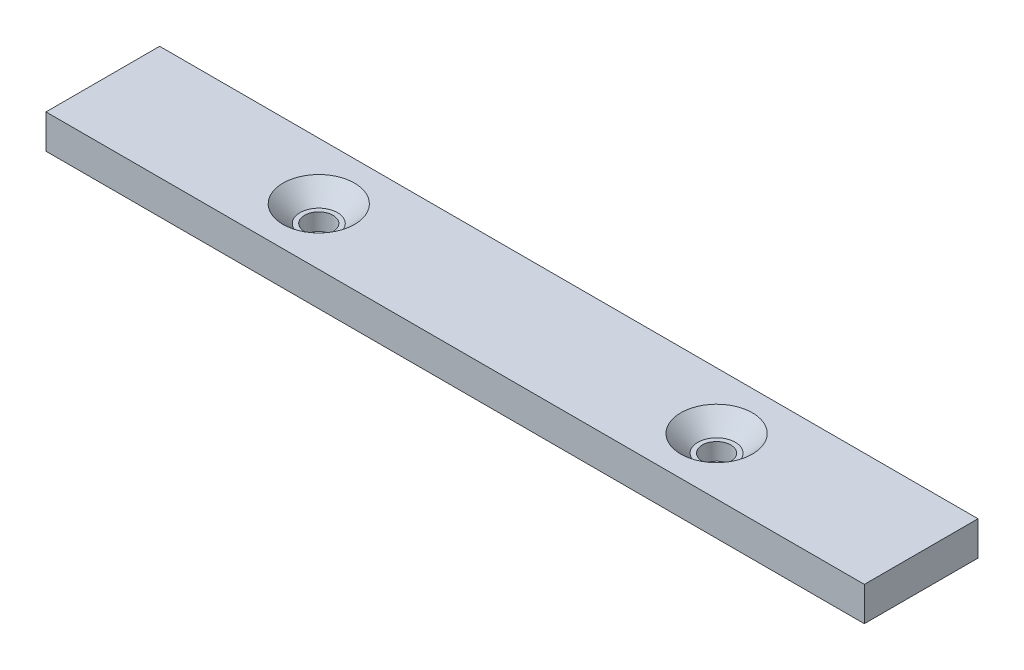
ISO-10303-21;
HEADER;
FILE_DESCRIPTION(('STEP AP214'),'2;1');
FILE_NAME('part.step','',(''),(''),'','','');
FILE_SCHEMA(('AUTOMOTIVE_DESIGN { 1 0 10303 214 1 1 1 1 }'));
ENDSEC;
DATA;
#1=APPLICATION_CONTEXT('core data for automotive mechanical design processes');
#2=APPLICATION_PROTOCOL_DEFINITION('international standard','automotive_design',2000,#1);
#3=PRODUCT_CONTEXT('',#1,'mechanical');
#4=PRODUCT('Part','Part','',(#3));
#5=PRODUCT_RELATED_PRODUCT_CATEGORY('part','',(#4));
#6=PRODUCT_DEFINITION_FORMATION('','',#4);
#7=PRODUCT_DEFINITION_CONTEXT('part definition',#1,'design');
#8=PRODUCT_DEFINITION('design','',#6,#7);
#9=PRODUCT_DEFINITION_SHAPE('','',#8);
#10=(LENGTH_UNIT() NAMED_UNIT(*) SI_UNIT(.MILLI.,.METRE.));
#11=(NAMED_UNIT(*) PLANE_ANGLE_UNIT() SI_UNIT($,.RADIAN.));
#12=(NAMED_UNIT(*) SI_UNIT($,.STERADIAN.) SOLID_ANGLE_UNIT());
#13=UNCERTAINTY_MEASURE_WITH_UNIT(LENGTH_MEASURE(1.E-05),#10,'distance_accuracy_value','');
#14=(GEOMETRIC_REPRESENTATION_CONTEXT(3) GLOBAL_UNCERTAINTY_ASSIGNED_CONTEXT((#13)) GLOBAL_UNIT_ASSIGNED_CONTEXT((#10,
#11,#12)) REPRESENTATION_CONTEXT('',''));
#15=CARTESIAN_POINT('',(0.,0.,0.));
#16=DIRECTION('',(0.,0.,1.));
#17=DIRECTION('',(1.,0.,0.));
#18=AXIS2_PLACEMENT_3D('',#15,#16,#17);
#19=CARTESIAN_POINT('',(-72.,6.,10.));
#20=DIRECTION('',(1.,0.,0.));
#21=DIRECTION('',(0.,0.,-1.));
#22=AXIS2_PLACEMENT_3D('',#19,#20,#21);
#23=PLANE('',#22);
#24=DIRECTION('',(0.,0.,1.));
#25=VECTOR('',#24,1.);
#26=CARTESIAN_POINT('',(-72.,0.,10.));
#27=LINE('',#26,#25);
#28=CARTESIAN_POINT('',(-72.,0.,-9.99999999999999));
#29=VERTEX_POINT('',#28);
#30=CARTESIAN_POINT('',(-72.,0.,10.));
#31=VERTEX_POINT('',#30);
#32=EDGE_CURVE('E110',#29,#31,#27,.T.);
#33=ORIENTED_EDGE('',*,*,#32,.T.);
#34=DIRECTION('',(0.,-1.,0.));
#35=VECTOR('',#34,1.);
#36=CARTESIAN_POINT('',(-72.,6.,10.));
#37=LINE('',#36,#35);
#38=CARTESIAN_POINT('',(-72.,6.,10.));
#39=VERTEX_POINT('',#38);
#40=EDGE_CURVE('E11',#39,#31,#37,.T.);
#41=ORIENTED_EDGE('',*,*,#40,.F.);
#42=DIRECTION('',(0.,0.,1.));
#43=VECTOR('',#42,1.);
#44=CARTESIAN_POINT('',(-72.,6.,10.));
#45=LINE('',#44,#43);
#46=CARTESIAN_POINT('',(-72.,6.,-9.99999999999999));
#47=VERTEX_POINT('',#46);
#48=EDGE_CURVE('E93',#47,#39,#45,.T.);
#49=ORIENTED_EDGE('',*,*,#48,.F.);
#50=DIRECTION('',(0.,-1.,0.));
#51=VECTOR('',#50,1.);
#52=CARTESIAN_POINT('',(-72.,6.,-9.99999999999999));
#53=LINE('',#52,#51);
#54=EDGE_CURVE('E106',#47,#29,#53,.T.);
#55=ORIENTED_EDGE('',*,*,#54,.T.);
#56=EDGE_LOOP('',(#33,#41,#49,#55));
#57=FACE_BOUND('',#56,.T.);
#58=ADVANCED_FACE('F39',(#57),#23,.F.);
#59=CARTESIAN_POINT('',(72.,6.,9.99999999999998));
#60=DIRECTION('',(0.,0.,-1.));
#61=DIRECTION('',(-1.,0.,0.));
#62=AXIS2_PLACEMENT_3D('',#59,#60,#61);
#63=PLANE('',#62);
#64=DIRECTION('',(1.,0.,0.));
#65=VECTOR('',#64,1.);
#66=CARTESIAN_POINT('',(72.,0.,9.99999999999998));
#67=LINE('',#66,#65);
#68=CARTESIAN_POINT('',(72.,0.,9.99999999999998));
#69=VERTEX_POINT('',#68);
#70=EDGE_CURVE('E98',#31,#69,#67,.T.);
#71=ORIENTED_EDGE('',*,*,#70,.T.);
#72=DIRECTION('',(0.,-1.,0.));
#73=VECTOR('',#72,1.);
#74=CARTESIAN_POINT('',(72.,6.,9.99999999999998));
#75=LINE('',#74,#73);
#76=CARTESIAN_POINT('',(72.,6.,9.99999999999998));
#77=VERTEX_POINT('',#76);
#78=EDGE_CURVE('E49',#77,#69,#75,.T.);
#79=ORIENTED_EDGE('',*,*,#78,.F.);
#80=DIRECTION('',(1.,0.,0.));
#81=VECTOR('',#80,1.);
#82=CARTESIAN_POINT('',(72.,6.,9.99999999999998));
#83=LINE('',#82,#81);
#84=EDGE_CURVE('E88',#39,#77,#83,.T.);
#85=ORIENTED_EDGE('',*,*,#84,.F.);
#86=ORIENTED_EDGE('',*,*,#40,.T.);
#87=EDGE_LOOP('',(#71,#79,#85,#86));
#88=FACE_BOUND('',#87,.T.);
#89=ADVANCED_FACE('F97',(#88),#63,.F.);
#90=CARTESIAN_POINT('',(72.,6.,9.99999999999998));
#91=DIRECTION('',(-1.,0.,0.));
#92=DIRECTION('',(0.,0.,1.));
#93=AXIS2_PLACEMENT_3D('',#90,#91,#92);
#94=PLANE('',#93);
#95=DIRECTION('',(0.,0.,-1.));
#96=VECTOR('',#95,1.);
#97=CARTESIAN_POINT('',(72.,0.,9.99999999999998));
#98=LINE('',#97,#96);
#99=CARTESIAN_POINT('',(72.,0.,-10.));
#100=VERTEX_POINT('',#99);
#101=EDGE_CURVE('E75',#69,#100,#98,.T.);
#102=ORIENTED_EDGE('',*,*,#101,.T.);
#103=DIRECTION('',(0.,-1.,0.));
#104=VECTOR('',#103,1.);
#105=CARTESIAN_POINT('',(72.,6.,-10.));
#106=LINE('',#105,#104);
#107=CARTESIAN_POINT('',(72.,6.,-10.));
#108=VERTEX_POINT('',#107);
#109=EDGE_CURVE('E100',#108,#100,#106,.T.);
#110=ORIENTED_EDGE('',*,*,#109,.F.);
#111=DIRECTION('',(0.,0.,-1.));
#112=VECTOR('',#111,1.);
#113=CARTESIAN_POINT('',(72.,6.,9.99999999999998));
#114=LINE('',#113,#112);
#115=EDGE_CURVE('E91',#77,#108,#114,.T.);
#116=ORIENTED_EDGE('',*,*,#115,.F.);
#117=ORIENTED_EDGE('',*,*,#78,.T.);
#118=EDGE_LOOP('',(#102,#110,#116,#117));
#119=FACE_BOUND('',#118,.T.);
#120=ADVANCED_FACE('F102',(#119),#94,.F.);
#121=CARTESIAN_POINT('',(72.,6.,-10.));
#122=DIRECTION('',(0.,0.,1.));
#123=DIRECTION('',(1.,0.,0.));
#124=AXIS2_PLACEMENT_3D('',#121,#122,#123);
#125=PLANE('',#124);
#126=DIRECTION('',(-1.,0.,0.));
#127=VECTOR('',#126,1.);
#128=CARTESIAN_POINT('',(72.,0.,-10.));
#129=LINE('',#128,#127);
#130=EDGE_CURVE('E81',#100,#29,#129,.T.);
#131=ORIENTED_EDGE('',*,*,#130,.T.);
#132=ORIENTED_EDGE('',*,*,#54,.F.);
#133=DIRECTION('',(-1.,0.,0.));
#134=VECTOR('',#133,1.);
#135=CARTESIAN_POINT('',(72.,6.,-10.));
#136=LINE('',#135,#134);
#137=EDGE_CURVE('E58',#108,#47,#136,.T.);
#138=ORIENTED_EDGE('',*,*,#137,.F.);
#139=ORIENTED_EDGE('',*,*,#109,.T.);
#140=EDGE_LOOP('',(#131,#132,#138,#139));
#141=FACE_BOUND('',#140,.T.);
#142=ADVANCED_FACE('F175',(#141),#125,.F.);
#143=CARTESIAN_POINT('',(0.,6.,0.));
#144=DIRECTION('',(0.,1.,0.));
#145=DIRECTION('',(0.,0.,1.));
#146=AXIS2_PLACEMENT_3D('',#143,#144,#145);
#147=PLANE('',#146);
#148=CARTESIAN_POINT('',(-34.,6.,0.));
#149=DIRECTION('',(0.,1.,0.));
#150=DIRECTION('',(0.,0.,1.));
#151=AXIS2_PLACEMENT_3D('',#148,#149,#150);
#152=CIRCLE('',#151,6.3);
#153=CARTESIAN_POINT('',(-34.,6.,6.3));
#154=VERTEX_POINT('',#153);
#155=EDGE_CURVE('E144',#154,#154,#152,.T.);
#156=ORIENTED_EDGE('',*,*,#155,.F.);
#157=EDGE_LOOP('',(#156));
#158=FACE_BOUND('',#157,.T.);
#159=CARTESIAN_POINT('',(36.,6.,0.));
#160=DIRECTION('',(0.,1.,0.));
#161=DIRECTION('',(0.,0.,1.));
#162=AXIS2_PLACEMENT_3D('',#159,#160,#161);
#163=CIRCLE('',#162,6.3);
#164=CARTESIAN_POINT('',(36.,6.,6.30000000000001));
#165=VERTEX_POINT('',#164);
#166=EDGE_CURVE('E126',#165,#165,#163,.T.);
#167=ORIENTED_EDGE('',*,*,#166,.F.);
#168=EDGE_LOOP('',(#167));
#169=FACE_BOUND('',#168,.T.);
#170=ORIENTED_EDGE('',*,*,#48,.T.);
#171=ORIENTED_EDGE('',*,*,#84,.T.);
#172=ORIENTED_EDGE('',*,*,#115,.T.);
#173=ORIENTED_EDGE('',*,*,#137,.T.);
#174=EDGE_LOOP('',(#170,#171,#172,#173));
#175=FACE_BOUND('',#174,.T.);
#176=ADVANCED_FACE('F89',(#158,#169,#175),#147,.T.);
#177=CARTESIAN_POINT('',(0.,0.,0.));
#178=DIRECTION('',(0.,1.,0.));
#179=DIRECTION('',(0.,0.,1.));
#180=AXIS2_PLACEMENT_3D('',#177,#178,#179);
#181=PLANE('',#180);
#182=CARTESIAN_POINT('',(-34.,0.,0.));
#183=DIRECTION('',(0.,1.,0.));
#184=DIRECTION('',(0.,0.,1.));
#185=AXIS2_PLACEMENT_3D('',#182,#183,#184);
#186=CIRCLE('',#185,2.5);
#187=CARTESIAN_POINT('',(-34.,0.,2.5));
#188=VERTEX_POINT('',#187);
#189=EDGE_CURVE('E42',#188,#188,#186,.T.);
#190=ORIENTED_EDGE('',*,*,#189,.T.);
#191=EDGE_LOOP('',(#190));
#192=FACE_BOUND('',#191,.T.);
#193=CARTESIAN_POINT('',(36.,0.,0.));
#194=DIRECTION('',(0.,1.,0.));
#195=DIRECTION('',(0.,0.,1.));
#196=AXIS2_PLACEMENT_3D('',#193,#194,#195);
#197=CIRCLE('',#196,2.5);
#198=CARTESIAN_POINT('',(36.,0.,2.50000000000001));
#199=VERTEX_POINT('',#198);
#200=EDGE_CURVE('E114',#199,#199,#197,.T.);
#201=ORIENTED_EDGE('',*,*,#200,.T.);
#202=EDGE_LOOP('',(#201));
#203=FACE_BOUND('',#202,.T.);
#204=ORIENTED_EDGE('',*,*,#32,.F.);
#205=ORIENTED_EDGE('',*,*,#130,.F.);
#206=ORIENTED_EDGE('',*,*,#101,.F.);
#207=ORIENTED_EDGE('',*,*,#70,.F.);
#208=EDGE_LOOP('',(#204,#205,#206,#207));
#209=FACE_BOUND('',#208,.T.);
#210=ADVANCED_FACE('F174',(#192,#203,#209),#181,.F.);
#211=CARTESIAN_POINT('',(36.,6.,0.));
#212=DIRECTION('',(0.,1.,0.));
#213=DIRECTION('',(0.,0.,1.));
#214=AXIS2_PLACEMENT_3D('',#211,#212,#213);
#215=CYLINDRICAL_SURFACE('',#214,2.5);
#216=CARTESIAN_POINT('',(36.,3.,0.));
#217=DIRECTION('',(0.,1.,0.));
#218=DIRECTION('',(0.,0.,1.));
#219=AXIS2_PLACEMENT_3D('',#216,#217,#218);
#220=CIRCLE('',#219,2.5);
#221=CARTESIAN_POINT('',(36.,3.,2.50000000000001));
#222=VERTEX_POINT('',#221);
#223=EDGE_CURVE('E137',#222,#222,#220,.T.);
#224=ORIENTED_EDGE('',*,*,#223,.T.);
#225=EDGE_LOOP('',(#224));
#226=FACE_BOUND('',#225,.T.);
#227=ORIENTED_EDGE('',*,*,#200,.F.);
#228=EDGE_LOOP('',(#227));
#229=FACE_BOUND('',#228,.T.);
#230=ADVANCED_FACE('F181',(#226,#229),#215,.F.);
#231=CARTESIAN_POINT('',(36.,6.,0.));
#232=DIRECTION('',(0.,1.,0.));
#233=DIRECTION('',(0.,0.,1.));
#234=AXIS2_PLACEMENT_3D('',#231,#232,#233);
#235=CONICAL_SURFACE('',#234,6.3,0.785398163397449);
#236=CARTESIAN_POINT('',(36.,3.,0.));
#237=DIRECTION('',(0.,1.,0.));
#238=DIRECTION('',(0.,0.,1.));
#239=AXIS2_PLACEMENT_3D('',#236,#237,#238);
#240=CIRCLE('',#239,3.3);
#241=CARTESIAN_POINT('',(36.,3.,3.3));
#242=VERTEX_POINT('',#241);
#243=EDGE_CURVE('E131',#242,#242,#240,.T.);
#244=ORIENTED_EDGE('',*,*,#243,.F.);
#245=EDGE_LOOP('',(#244));
#246=FACE_BOUND('',#245,.T.);
#247=ORIENTED_EDGE('',*,*,#166,.T.);
#248=EDGE_LOOP('',(#247));
#249=FACE_BOUND('',#248,.T.);
#250=ADVANCED_FACE('F222',(#246,#249),#235,.F.);
#251=CARTESIAN_POINT('',(39.3,3.,0.));
#252=DIRECTION('',(0.,-1.,0.));
#253=DIRECTION('',(0.,0.,-1.));
#254=AXIS2_PLACEMENT_3D('',#251,#252,#253);
#255=PLANE('',#254);
#256=ORIENTED_EDGE('',*,*,#223,.F.);
#257=EDGE_LOOP('',(#256));
#258=FACE_BOUND('',#257,.T.);
#259=ORIENTED_EDGE('',*,*,#243,.T.);
#260=EDGE_LOOP('',(#259));
#261=FACE_BOUND('',#260,.T.);
#262=ADVANCED_FACE('F232',(#258,#261),#255,.F.);
#263=CARTESIAN_POINT('',(-34.,6.,0.));
#264=DIRECTION('',(0.,1.,0.));
#265=DIRECTION('',(0.,0.,1.));
#266=AXIS2_PLACEMENT_3D('',#263,#264,#265);
#267=CYLINDRICAL_SURFACE('',#266,2.5);
#268=CARTESIAN_POINT('',(-34.,3.,0.));
#269=DIRECTION('',(0.,1.,0.));
#270=DIRECTION('',(0.,0.,1.));
#271=AXIS2_PLACEMENT_3D('',#268,#269,#270);
#272=CIRCLE('',#271,2.5);
#273=CARTESIAN_POINT('',(-34.,3.,2.5));
#274=VERTEX_POINT('',#273);
#275=EDGE_CURVE('E152',#274,#274,#272,.T.);
#276=ORIENTED_EDGE('',*,*,#275,.T.);
#277=EDGE_LOOP('',(#276));
#278=FACE_BOUND('',#277,.T.);
#279=ORIENTED_EDGE('',*,*,#189,.F.);
#280=EDGE_LOOP('',(#279));
#281=FACE_BOUND('',#280,.T.);
#282=ADVANCED_FACE('F157',(#278,#281),#267,.F.);
#283=CARTESIAN_POINT('',(-34.,6.,0.));
#284=DIRECTION('',(0.,1.,0.));
#285=DIRECTION('',(0.,0.,1.));
#286=AXIS2_PLACEMENT_3D('',#283,#284,#285);
#287=CONICAL_SURFACE('',#286,6.3,0.785398163397448);
#288=CARTESIAN_POINT('',(-34.,3.,0.));
#289=DIRECTION('',(0.,1.,0.));
#290=DIRECTION('',(0.,0.,1.));
#291=AXIS2_PLACEMENT_3D('',#288,#289,#290);
#292=CIRCLE('',#291,3.3);
#293=CARTESIAN_POINT('',(-34.,3.,3.3));
#294=VERTEX_POINT('',#293);
#295=EDGE_CURVE('E148',#294,#294,#292,.T.);
#296=ORIENTED_EDGE('',*,*,#295,.F.);
#297=EDGE_LOOP('',(#296));
#298=FACE_BOUND('',#297,.T.);
#299=ORIENTED_EDGE('',*,*,#155,.T.);
#300=EDGE_LOOP('',(#299));
#301=FACE_BOUND('',#300,.T.);
#302=ADVANCED_FACE('F163',(#298,#301),#287,.F.);
#303=CARTESIAN_POINT('',(-30.7,3.,0.));
#304=DIRECTION('',(0.,-1.,0.));
#305=DIRECTION('',(0.,0.,-1.));
#306=AXIS2_PLACEMENT_3D('',#303,#304,#305);
#307=PLANE('',#306);
#308=ORIENTED_EDGE('',*,*,#275,.F.);
#309=EDGE_LOOP('',(#308));
#310=FACE_BOUND('',#309,.T.);
#311=ORIENTED_EDGE('',*,*,#295,.T.);
#312=EDGE_LOOP('',(#311));
#313=FACE_BOUND('',#312,.T.);
#314=ADVANCED_FACE('F160',(#310,#313),#307,.F.);
#315=CLOSED_SHELL('',(#58,#89,#120,#142,#176,#210,#230,#250,#262,#282,#302,#314));
#316=MANIFOLD_SOLID_BREP('B2',#315);
#317=ADVANCED_BREP_SHAPE_REPRESENTATION('',(#18,#316),#14);
#318=SHAPE_DEFINITION_REPRESENTATION(#9,#317);
ENDSEC;
END-ISO-10303-21;
